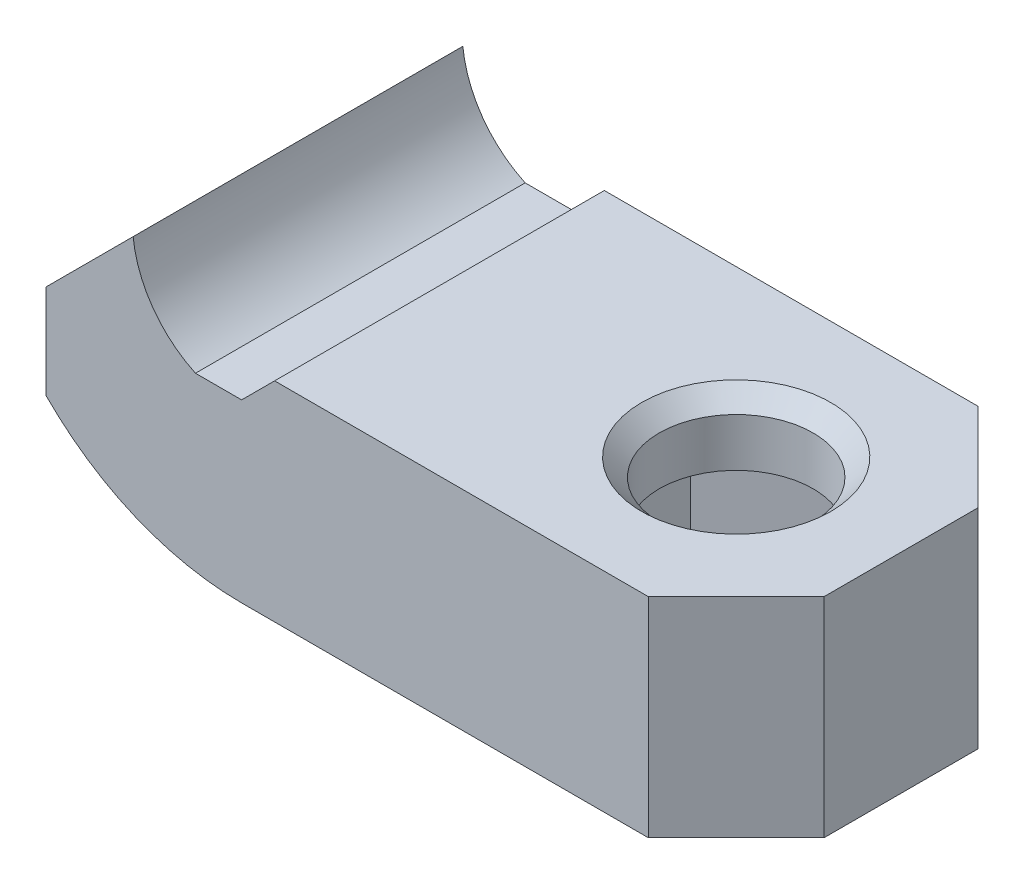
ISO-10303-21;
HEADER;
FILE_DESCRIPTION(('STEP AP214'),'2;1');
FILE_NAME('part.step','',(''),(''),'','','');
FILE_SCHEMA(('AUTOMOTIVE_DESIGN { 1 0 10303 214 1 1 1 1 }'));
ENDSEC;
DATA;
#1=APPLICATION_CONTEXT('core data for automotive mechanical design processes');
#2=APPLICATION_PROTOCOL_DEFINITION('international standard','automotive_design',2000,#1);
#3=PRODUCT_CONTEXT('',#1,'mechanical');
#4=PRODUCT('Part','Part','',(#3));
#5=PRODUCT_RELATED_PRODUCT_CATEGORY('part','',(#4));
#6=PRODUCT_DEFINITION_FORMATION('','',#4);
#7=PRODUCT_DEFINITION_CONTEXT('part definition',#1,'design');
#8=PRODUCT_DEFINITION('design','',#6,#7);
#9=PRODUCT_DEFINITION_SHAPE('','',#8);
#10=(LENGTH_UNIT() NAMED_UNIT(*) SI_UNIT(.MILLI.,.METRE.));
#11=(NAMED_UNIT(*) PLANE_ANGLE_UNIT() SI_UNIT($,.RADIAN.));
#12=(NAMED_UNIT(*) SI_UNIT($,.STERADIAN.) SOLID_ANGLE_UNIT());
#13=UNCERTAINTY_MEASURE_WITH_UNIT(LENGTH_MEASURE(1.E-05),#10,'distance_accuracy_value','');
#14=(GEOMETRIC_REPRESENTATION_CONTEXT(3) GLOBAL_UNCERTAINTY_ASSIGNED_CONTEXT((#13)) GLOBAL_UNIT_ASSIGNED_CONTEXT((#10,
#11,#12)) REPRESENTATION_CONTEXT('',''));
#15=CARTESIAN_POINT('',(0.,0.,0.));
#16=DIRECTION('',(0.,0.,1.));
#17=DIRECTION('',(1.,0.,0.));
#18=AXIS2_PLACEMENT_3D('',#15,#16,#17);
#19=CARTESIAN_POINT('',(-2.1,4.,7.5));
#20=DIRECTION('',(0.,-1.,0.));
#21=DIRECTION('',(1.,0.,0.));
#22=AXIS2_PLACEMENT_3D('',#19,#20,#21);
#23=PLANE('',#22);
#24=DIRECTION('',(-1.,0.,0.));
#25=VECTOR('',#24,1.);
#26=CARTESIAN_POINT('',(-2.1,4.,-7.5));
#27=LINE('',#26,#25);
#28=CARTESIAN_POINT('',(0.,4.,-7.5));
#29=VERTEX_POINT('',#28);
#30=CARTESIAN_POINT('',(-2.1,4.,-7.5));
#31=VERTEX_POINT('',#30);
#32=EDGE_CURVE('E234',#29,#31,#27,.T.);
#33=ORIENTED_EDGE('',*,*,#32,.T.);
#34=DIRECTION('',(0.,0.,-1.));
#35=VECTOR('',#34,1.);
#36=CARTESIAN_POINT('',(-2.1,4.,7.5));
#37=LINE('',#36,#35);
#38=CARTESIAN_POINT('',(-2.1,4.,7.5));
#39=VERTEX_POINT('',#38);
#40=EDGE_CURVE('E272',#39,#31,#37,.T.);
#41=ORIENTED_EDGE('',*,*,#40,.F.);
#42=DIRECTION('',(-1.,0.,0.));
#43=VECTOR('',#42,1.);
#44=CARTESIAN_POINT('',(-2.1,4.,7.5));
#45=LINE('',#44,#43);
#46=CARTESIAN_POINT('',(0.,4.,7.5));
#47=VERTEX_POINT('',#46);
#48=EDGE_CURVE('E239',#47,#39,#45,.T.);
#49=ORIENTED_EDGE('',*,*,#48,.F.);
#50=DIRECTION('',(0.,0.,-1.));
#51=VECTOR('',#50,1.);
#52=CARTESIAN_POINT('',(0.,4.,7.5));
#53=LINE('',#52,#51);
#54=EDGE_CURVE('E275',#47,#29,#53,.T.);
#55=ORIENTED_EDGE('',*,*,#54,.T.);
#56=EDGE_LOOP('',(#33,#41,#49,#55));
#57=FACE_BOUND('',#56,.T.);
#58=ADVANCED_FACE('F35',(#57),#23,.F.);
#59=CARTESIAN_POINT('',(0.,8.5,7.5));
#60=DIRECTION('',(0.,0.,-1.));
#61=DIRECTION('',(-1.,0.,0.));
#62=AXIS2_PLACEMENT_3D('',#59,#60,#61);
#63=CYLINDRICAL_SURFACE('',#62,4.96588360717405);
#64=CARTESIAN_POINT('',(0.,8.5,-7.5));
#65=DIRECTION('',(0.,0.,-1.));
#66=DIRECTION('',(-1.,0.,0.));
#67=AXIS2_PLACEMENT_3D('',#64,#65,#66);
#68=CIRCLE('',#67,4.96588360717405);
#69=CARTESIAN_POINT('',(-4.9367864366808,7.9632135633192,-7.5));
#70=VERTEX_POINT('',#69);
#71=EDGE_CURVE('E253',#31,#70,#68,.T.);
#72=ORIENTED_EDGE('',*,*,#71,.T.);
#73=DIRECTION('',(0.,0.,-1.));
#74=VECTOR('',#73,1.);
#75=CARTESIAN_POINT('',(-4.9367864366808,7.9632135633192,7.5));
#76=LINE('',#75,#74);
#77=CARTESIAN_POINT('',(-4.9367864366808,7.9632135633192,7.5));
#78=VERTEX_POINT('',#77);
#79=EDGE_CURVE('E269',#78,#70,#76,.T.);
#80=ORIENTED_EDGE('',*,*,#79,.F.);
#81=CARTESIAN_POINT('',(0.,8.5,7.5));
#82=DIRECTION('',(0.,0.,-1.));
#83=DIRECTION('',(-1.,0.,0.));
#84=AXIS2_PLACEMENT_3D('',#81,#82,#83);
#85=CIRCLE('',#84,4.96588360717405);
#86=EDGE_CURVE('E241',#39,#78,#85,.T.);
#87=ORIENTED_EDGE('',*,*,#86,.F.);
#88=ORIENTED_EDGE('',*,*,#40,.T.);
#89=EDGE_LOOP('',(#72,#80,#87,#88));
#90=FACE_BOUND('',#89,.T.);
#91=ADVANCED_FACE('F388',(#90),#63,.F.);
#92=CARTESIAN_POINT('',(-8.9,4.,7.5));
#93=DIRECTION('',(0.707106781186547,-0.707106781186548,0.));
#94=DIRECTION('',(0.707106781186548,0.707106781186547,0.));
#95=AXIS2_PLACEMENT_3D('',#92,#93,#94);
#96=PLANE('',#95);
#97=DIRECTION('',(-0.707106781186548,-0.707106781186547,0.));
#98=VECTOR('',#97,1.);
#99=CARTESIAN_POINT('',(-8.9,4.,-7.5));
#100=LINE('',#99,#98);
#101=CARTESIAN_POINT('',(-8.9,4.,-7.5));
#102=VERTEX_POINT('',#101);
#103=EDGE_CURVE('E255',#70,#102,#100,.T.);
#104=ORIENTED_EDGE('',*,*,#103,.T.);
#105=DIRECTION('',(0.,0.,-1.));
#106=VECTOR('',#105,1.);
#107=CARTESIAN_POINT('',(-8.9,4.,7.5));
#108=LINE('',#107,#106);
#109=CARTESIAN_POINT('',(-8.9,4.,7.5));
#110=VERTEX_POINT('',#109);
#111=EDGE_CURVE('E266',#110,#102,#108,.T.);
#112=ORIENTED_EDGE('',*,*,#111,.F.);
#113=DIRECTION('',(-0.707106781186548,-0.707106781186547,0.));
#114=VECTOR('',#113,1.);
#115=CARTESIAN_POINT('',(-8.9,4.,7.5));
#116=LINE('',#115,#114);
#117=EDGE_CURVE('E244',#78,#110,#116,.T.);
#118=ORIENTED_EDGE('',*,*,#117,.F.);
#119=ORIENTED_EDGE('',*,*,#79,.T.);
#120=EDGE_LOOP('',(#104,#112,#118,#119));
#121=FACE_BOUND('',#120,.T.);
#122=ADVANCED_FACE('F394',(#121),#96,.F.);
#123=CARTESIAN_POINT('',(-8.9,4.,7.5));
#124=DIRECTION('',(1.,0.,0.));
#125=DIRECTION('',(0.,1.,0.));
#126=AXIS2_PLACEMENT_3D('',#123,#124,#125);
#127=PLANE('',#126);
#128=DIRECTION('',(0.,-1.,0.));
#129=VECTOR('',#128,1.);
#130=CARTESIAN_POINT('',(-8.9,4.,-7.5));
#131=LINE('',#130,#129);
#132=CARTESIAN_POINT('',(-8.9,-0.277243302996677,-7.5));
#133=VERTEX_POINT('',#132);
#134=EDGE_CURVE('E257',#102,#133,#131,.T.);
#135=ORIENTED_EDGE('',*,*,#134,.T.);
#136=DIRECTION('',(0.,0.,-1.));
#137=VECTOR('',#136,1.);
#138=CARTESIAN_POINT('',(-8.9,-0.277243302996677,7.5));
#139=LINE('',#138,#137);
#140=CARTESIAN_POINT('',(-8.9,-0.277243302996677,7.5));
#141=VERTEX_POINT('',#140);
#142=EDGE_CURVE('E263',#141,#133,#139,.T.);
#143=ORIENTED_EDGE('',*,*,#142,.F.);
#144=DIRECTION('',(0.,-1.,0.));
#145=VECTOR('',#144,1.);
#146=CARTESIAN_POINT('',(-8.9,4.,7.5));
#147=LINE('',#146,#145);
#148=EDGE_CURVE('E246',#110,#141,#147,.T.);
#149=ORIENTED_EDGE('',*,*,#148,.F.);
#150=ORIENTED_EDGE('',*,*,#111,.T.);
#151=EDGE_LOOP('',(#135,#143,#149,#150));
#152=FACE_BOUND('',#151,.T.);
#153=ADVANCED_FACE('F628',(#152),#127,.F.);
#154=CARTESIAN_POINT('',(0.,8.5,7.5));
#155=DIRECTION('',(0.,0.,-1.));
#156=DIRECTION('',(-1.,0.,0.));
#157=AXIS2_PLACEMENT_3D('',#154,#155,#156);
#158=CYLINDRICAL_SURFACE('',#157,12.5);
#159=CARTESIAN_POINT('',(0.,8.5,-7.5));
#160=DIRECTION('',(0.,0.,1.));
#161=DIRECTION('',(-1.,0.,0.));
#162=AXIS2_PLACEMENT_3D('',#159,#160,#161);
#163=CIRCLE('',#162,12.5);
#164=CARTESIAN_POINT('',(0.,-4.,-7.5));
#165=VERTEX_POINT('',#164);
#166=EDGE_CURVE('E242',#133,#165,#163,.T.);
#167=ORIENTED_EDGE('',*,*,#166,.T.);
#168=DIRECTION('',(0.,0.,-1.));
#169=VECTOR('',#168,1.);
#170=CARTESIAN_POINT('',(0.,-4.,7.5));
#171=LINE('',#170,#169);
#172=CARTESIAN_POINT('',(0.,-4.,7.5));
#173=VERTEX_POINT('',#172);
#174=EDGE_CURVE('E251',#173,#165,#171,.T.);
#175=ORIENTED_EDGE('',*,*,#174,.F.);
#176=CARTESIAN_POINT('',(0.,8.5,7.5));
#177=DIRECTION('',(0.,0.,1.));
#178=DIRECTION('',(-1.,0.,0.));
#179=AXIS2_PLACEMENT_3D('',#176,#177,#178);
#180=CIRCLE('',#179,12.5);
#181=EDGE_CURVE('E248',#141,#173,#180,.T.);
#182=ORIENTED_EDGE('',*,*,#181,.F.);
#183=ORIENTED_EDGE('',*,*,#142,.T.);
#184=EDGE_LOOP('',(#167,#175,#182,#183));
#185=FACE_BOUND('',#184,.T.);
#186=ADVANCED_FACE('F600',(#185),#158,.T.);
#187=CARTESIAN_POINT('',(0.,8.5,7.5));
#188=DIRECTION('',(0.,0.,-1.));
#189=DIRECTION('',(-1.,0.,0.));
#190=AXIS2_PLACEMENT_3D('',#187,#188,#189);
#191=PLANE('',#190);
#192=DIRECTION('',(-1.,0.,0.));
#193=VECTOR('',#192,1.);
#194=CARTESIAN_POINT('',(22.5,-4.,7.5));
#195=LINE('',#194,#193);
#196=CARTESIAN_POINT('',(18.5,-4.,7.5));
#197=VERTEX_POINT('',#196);
#198=EDGE_CURVE('E221',#197,#173,#195,.T.);
#199=ORIENTED_EDGE('',*,*,#198,.F.);
#200=DIRECTION('',(0.,1.,0.));
#201=VECTOR('',#200,1.);
#202=CARTESIAN_POINT('',(18.5,5.5,7.5));
#203=LINE('',#202,#201);
#204=CARTESIAN_POINT('',(18.5,5.49999999999707,7.5));
#205=VERTEX_POINT('',#204);
#206=EDGE_CURVE('E296',#197,#205,#203,.T.);
#207=ORIENTED_EDGE('',*,*,#206,.T.);
#208=DIRECTION('',(1.,7.32466336260718E-13,0.));
#209=VECTOR('',#208,1.);
#210=CARTESIAN_POINT('',(1.49999999998461,5.49999999998461,7.5));
#211=LINE('',#210,#209);
#212=CARTESIAN_POINT('',(1.49999999998461,5.49999999998461,7.5));
#213=VERTEX_POINT('',#212);
#214=EDGE_CURVE('E217',#213,#205,#211,.T.);
#215=ORIENTED_EDGE('',*,*,#214,.F.);
#216=DIRECTION('',(0.707106781186547,0.707106781186549,0.));
#217=VECTOR('',#216,1.);
#218=CARTESIAN_POINT('',(0.,4.,7.5));
#219=LINE('',#218,#217);
#220=EDGE_CURVE('E214',#47,#213,#219,.T.);
#221=ORIENTED_EDGE('',*,*,#220,.F.);
#222=ORIENTED_EDGE('',*,*,#48,.T.);
#223=ORIENTED_EDGE('',*,*,#86,.T.);
#224=ORIENTED_EDGE('',*,*,#117,.T.);
#225=ORIENTED_EDGE('',*,*,#148,.T.);
#226=ORIENTED_EDGE('',*,*,#181,.T.);
#227=EDGE_LOOP('',(#199,#207,#215,#221,#222,#223,#224,#225,#226));
#228=FACE_BOUND('',#227,.T.);
#229=ADVANCED_FACE('F590',(#228),#191,.F.);
#230=CARTESIAN_POINT('',(0.,8.5,-7.5));
#231=DIRECTION('',(0.,0.,-1.));
#232=DIRECTION('',(-1.,0.,0.));
#233=AXIS2_PLACEMENT_3D('',#230,#231,#232);
#234=PLANE('',#233);
#235=DIRECTION('',(1.,7.32466336260718E-13,0.));
#236=VECTOR('',#235,1.);
#237=CARTESIAN_POINT('',(1.49999999998461,5.49999999998461,-7.5));
#238=LINE('',#237,#236);
#239=CARTESIAN_POINT('',(1.49999999998461,5.49999999998461,-7.5));
#240=VERTEX_POINT('',#239);
#241=CARTESIAN_POINT('',(18.5,5.49999999999707,-7.5));
#242=VERTEX_POINT('',#241);
#243=EDGE_CURVE('E227',#240,#242,#238,.T.);
#244=ORIENTED_EDGE('',*,*,#243,.T.);
#245=DIRECTION('',(0.,-1.,0.));
#246=VECTOR('',#245,1.);
#247=CARTESIAN_POINT('',(18.5,8.5,-7.5));
#248=LINE('',#247,#246);
#249=CARTESIAN_POINT('',(18.5,-4.,-7.5));
#250=VERTEX_POINT('',#249);
#251=EDGE_CURVE('E278',#242,#250,#248,.T.);
#252=ORIENTED_EDGE('',*,*,#251,.T.);
#253=DIRECTION('',(-1.,0.,0.));
#254=VECTOR('',#253,1.);
#255=CARTESIAN_POINT('',(22.5,-4.,-7.5));
#256=LINE('',#255,#254);
#257=EDGE_CURVE('E218',#250,#165,#256,.T.);
#258=ORIENTED_EDGE('',*,*,#257,.T.);
#259=ORIENTED_EDGE('',*,*,#166,.F.);
#260=ORIENTED_EDGE('',*,*,#134,.F.);
#261=ORIENTED_EDGE('',*,*,#103,.F.);
#262=ORIENTED_EDGE('',*,*,#71,.F.);
#263=ORIENTED_EDGE('',*,*,#32,.F.);
#264=DIRECTION('',(0.707106781186547,0.707106781186549,0.));
#265=VECTOR('',#264,1.);
#266=CARTESIAN_POINT('',(0.,4.,-7.5));
#267=LINE('',#266,#265);
#268=EDGE_CURVE('E224',#29,#240,#267,.T.);
#269=ORIENTED_EDGE('',*,*,#268,.T.);
#270=EDGE_LOOP('',(#244,#252,#258,#259,#260,#261,#262,#263,#269));
#271=FACE_BOUND('',#270,.T.);
#272=ADVANCED_FACE('F582',(#271),#234,.T.);
#273=CARTESIAN_POINT('',(22.5,-4.,7.5));
#274=DIRECTION('',(0.,-1.,0.));
#275=DIRECTION('',(1.,0.,0.));
#276=AXIS2_PLACEMENT_3D('',#273,#274,#275);
#277=PLANE('',#276);
#278=DIRECTION('',(-0.866025403784439,0.,0.5));
#279=VECTOR('',#278,1.);
#280=CARTESIAN_POINT('',(9.69999999999597,-4.,-3.52183664205672));
#281=LINE('',#280,#279);
#282=CARTESIAN_POINT('',(14.999999999996,-4.,-6.58179306876174));
#283=VERTEX_POINT('',#282);
#284=CARTESIAN_POINT('',(9.29999999999597,-4.,-3.29089653438087));
#285=VERTEX_POINT('',#284);
#286=EDGE_CURVE('E307',#283,#285,#281,.T.);
#287=ORIENTED_EDGE('',*,*,#286,.T.);
#288=DIRECTION('',(0.,0.,1.));
#289=VECTOR('',#288,1.);
#290=CARTESIAN_POINT('',(9.29999999999597,-4.,2.82901631902917));
#291=LINE('',#290,#289);
#292=CARTESIAN_POINT('',(9.29999999999597,-4.,3.29089653438087));
#293=VERTEX_POINT('',#292);
#294=EDGE_CURVE('E317',#285,#293,#291,.T.);
#295=ORIENTED_EDGE('',*,*,#294,.T.);
#296=DIRECTION('',(0.866025403784439,0.,0.5));
#297=VECTOR('',#296,1.);
#298=CARTESIAN_POINT('',(14.599999999996,-4.,6.35085296108588));
#299=LINE('',#298,#297);
#300=CARTESIAN_POINT('',(14.999999999996,-4.,6.58179306876173));
#301=VERTEX_POINT('',#300);
#302=EDGE_CURVE('E315',#293,#301,#299,.T.);
#303=ORIENTED_EDGE('',*,*,#302,.T.);
#304=DIRECTION('',(0.866025403784439,0.,-0.5));
#305=VECTOR('',#304,1.);
#306=CARTESIAN_POINT('',(20.299999999996,-4.,3.52183664205672));
#307=LINE('',#306,#305);
#308=CARTESIAN_POINT('',(20.699999999996,-4.,3.29089653438087));
#309=VERTEX_POINT('',#308);
#310=EDGE_CURVE('E313',#301,#309,#307,.T.);
#311=ORIENTED_EDGE('',*,*,#310,.T.);
#312=DIRECTION('',(0.,0.,-1.));
#313=VECTOR('',#312,1.);
#314=CARTESIAN_POINT('',(20.699999999996,-4.,-2.82901631902917));
#315=LINE('',#314,#313);
#316=CARTESIAN_POINT('',(20.699999999996,-4.,-3.29089653438087));
#317=VERTEX_POINT('',#316);
#318=EDGE_CURVE('E311',#309,#317,#315,.T.);
#319=ORIENTED_EDGE('',*,*,#318,.T.);
#320=DIRECTION('',(-0.866025403784439,0.,-0.5));
#321=VECTOR('',#320,1.);
#322=CARTESIAN_POINT('',(15.399999999996,-4.,-6.35085296108589));
#323=LINE('',#322,#321);
#324=EDGE_CURVE('E309',#317,#283,#323,.T.);
#325=ORIENTED_EDGE('',*,*,#324,.T.);
#326=EDGE_LOOP('',(#287,#295,#303,#311,#319,#325));
#327=FACE_BOUND('',#326,.T.);
#328=ORIENTED_EDGE('',*,*,#257,.F.);
#329=DIRECTION('',(-0.707106781186546,0.,-0.707106781186549));
#330=VECTOR('',#329,1.);
#331=CARTESIAN_POINT('',(28.,-4.,2.00000000000002));
#332=LINE('',#331,#330);
#333=CARTESIAN_POINT('',(22.5,-4.,-3.49999999999999));
#334=VERTEX_POINT('',#333);
#335=EDGE_CURVE('E285',#250,#334,#332,.F.);
#336=ORIENTED_EDGE('',*,*,#335,.T.);
#337=DIRECTION('',(0.,0.,-1.));
#338=VECTOR('',#337,1.);
#339=CARTESIAN_POINT('',(22.5,-4.,7.5));
#340=LINE('',#339,#338);
#341=CARTESIAN_POINT('',(22.5,-4.,3.5));
#342=VERTEX_POINT('',#341);
#343=EDGE_CURVE('E231',#342,#334,#340,.T.);
#344=ORIENTED_EDGE('',*,*,#343,.F.);
#345=DIRECTION('',(-0.707106781186549,0.,0.707106781186546));
#346=VECTOR('',#345,1.);
#347=CARTESIAN_POINT('',(20.5,-4.,5.49999999999999));
#348=LINE('',#347,#346);
#349=EDGE_CURVE('E283',#342,#197,#348,.T.);
#350=ORIENTED_EDGE('',*,*,#349,.T.);
#351=ORIENTED_EDGE('',*,*,#198,.T.);
#352=ORIENTED_EDGE('',*,*,#174,.T.);
#353=EDGE_LOOP('',(#328,#336,#344,#350,#351,#352));
#354=FACE_BOUND('',#353,.T.);
#355=ADVANCED_FACE('F374',(#327,#354),#277,.T.);
#356=CARTESIAN_POINT('',(22.5,5.5,7.5));
#357=DIRECTION('',(1.,0.,0.));
#358=DIRECTION('',(0.,0.,-1.));
#359=AXIS2_PLACEMENT_3D('',#356,#357,#358);
#360=PLANE('',#359);
#361=ORIENTED_EDGE('',*,*,#343,.T.);
#362=DIRECTION('',(0.,1.,0.));
#363=VECTOR('',#362,1.);
#364=CARTESIAN_POINT('',(22.5,5.5,-3.49999999999999));
#365=LINE('',#364,#363);
#366=CARTESIAN_POINT('',(22.5,5.5,-3.49999999999999));
#367=VERTEX_POINT('',#366);
#368=EDGE_CURVE('E290',#334,#367,#365,.T.);
#369=ORIENTED_EDGE('',*,*,#368,.T.);
#370=DIRECTION('',(0.,0.,-1.));
#371=VECTOR('',#370,1.);
#372=CARTESIAN_POINT('',(22.5,5.5,7.5));
#373=LINE('',#372,#371);
#374=CARTESIAN_POINT('',(22.5,5.5,3.5));
#375=VERTEX_POINT('',#374);
#376=EDGE_CURVE('E235',#375,#367,#373,.T.);
#377=ORIENTED_EDGE('',*,*,#376,.F.);
#378=DIRECTION('',(0.,-1.,0.));
#379=VECTOR('',#378,1.);
#380=CARTESIAN_POINT('',(22.5,-4.,3.5));
#381=LINE('',#380,#379);
#382=EDGE_CURVE('E287',#375,#342,#381,.T.);
#383=ORIENTED_EDGE('',*,*,#382,.T.);
#384=EDGE_LOOP('',(#361,#369,#377,#383));
#385=FACE_BOUND('',#384,.T.);
#386=ADVANCED_FACE('F566',(#385),#360,.T.);
#387=CARTESIAN_POINT('',(1.49999999998461,5.49999999998461,7.5));
#388=DIRECTION('',(-7.32466336260718E-13,1.,0.));
#389=DIRECTION('',(-1.,-7.32466336260718E-13,0.));
#390=AXIS2_PLACEMENT_3D('',#387,#388,#389);
#391=PLANE('',#390);
#392=CARTESIAN_POINT('',(14.999999999996,5.4999999999945,0.));
#393=DIRECTION('',(-7.32466336260718E-13,1.,0.));
#394=DIRECTION('',(-1.,-7.32466336260718E-13,0.));
#395=AXIS2_PLACEMENT_3D('',#392,#393,#394);
#396=CIRCLE('',#395,4.3000000000041);
#397=CARTESIAN_POINT('',(10.6999999999919,5.49999999999135,0.));
#398=VERTEX_POINT('',#397);
#399=EDGE_CURVE('E301',#398,#398,#396,.F.);
#400=ORIENTED_EDGE('',*,*,#399,.T.);
#401=EDGE_LOOP('',(#400));
#402=FACE_BOUND('',#401,.T.);
#403=ORIENTED_EDGE('',*,*,#376,.T.);
#404=DIRECTION('',(0.707106781186546,5.17931913360819E-13,0.707106781186549));
#405=VECTOR('',#404,1.);
#406=CARTESIAN_POINT('',(17.4999999999923,5.49999999999634,-8.50000000000767));
#407=LINE('',#406,#405);
#408=EDGE_CURVE('E294',#367,#242,#407,.F.);
#409=ORIENTED_EDGE('',*,*,#408,.T.);
#410=ORIENTED_EDGE('',*,*,#243,.F.);
#411=DIRECTION('',(0.,0.,-1.));
#412=VECTOR('',#411,1.);
#413=CARTESIAN_POINT('',(1.49999999998461,5.49999999998461,7.5));
#414=LINE('',#413,#412);
#415=EDGE_CURVE('E223',#213,#240,#414,.T.);
#416=ORIENTED_EDGE('',*,*,#415,.F.);
#417=ORIENTED_EDGE('',*,*,#214,.T.);
#418=DIRECTION('',(0.707106781186549,5.17931913360821E-13,-0.707106781186546));
#419=VECTOR('',#418,1.);
#420=CARTESIAN_POINT('',(9.99999999999227,5.49999999999084,16.0000000000077));
#421=LINE('',#420,#419);
#422=EDGE_CURVE('E292',#205,#375,#421,.T.);
#423=ORIENTED_EDGE('',*,*,#422,.T.);
#424=EDGE_LOOP('',(#403,#409,#410,#416,#417,#423));
#425=FACE_BOUND('',#424,.T.);
#426=ADVANCED_FACE('F557',(#402,#425),#391,.T.);
#427=CARTESIAN_POINT('',(0.,4.,7.5));
#428=DIRECTION('',(-0.707106781186549,0.707106781186547,0.));
#429=DIRECTION('',(-0.707106781186547,-0.707106781186549,0.));
#430=AXIS2_PLACEMENT_3D('',#427,#428,#429);
#431=PLANE('',#430);
#432=ORIENTED_EDGE('',*,*,#268,.F.);
#433=ORIENTED_EDGE('',*,*,#54,.F.);
#434=ORIENTED_EDGE('',*,*,#220,.T.);
#435=ORIENTED_EDGE('',*,*,#415,.T.);
#436=EDGE_LOOP('',(#432,#433,#434,#435));
#437=FACE_BOUND('',#436,.T.);
#438=ADVANCED_FACE('F548',(#437),#431,.T.);
#439=CARTESIAN_POINT('',(14.999999999996,-4.,0.));
#440=DIRECTION('',(0.,1.,0.));
#441=DIRECTION('',(-1.,0.,0.));
#442=AXIS2_PLACEMENT_3D('',#439,#440,#441);
#443=CYLINDRICAL_SURFACE('',#442,3.5);
#444=CARTESIAN_POINT('',(14.999999999996,4.69999999998785,0.));
#445=DIRECTION('',(0.,1.,0.));
#446=DIRECTION('',(0.,0.,1.));
#447=AXIS2_PLACEMENT_3D('',#444,#445,#446);
#448=CIRCLE('',#447,3.5);
#449=CARTESIAN_POINT('',(14.999999999996,4.69999999998785,3.5));
#450=VERTEX_POINT('',#449);
#451=EDGE_CURVE('E298',#450,#450,#448,.T.);
#452=ORIENTED_EDGE('',*,*,#451,.T.);
#453=EDGE_LOOP('',(#452));
#454=FACE_BOUND('',#453,.T.);
#455=CARTESIAN_POINT('',(14.999999999996,2.49999999998351,0.));
#456=DIRECTION('',(0.,1.,0.));
#457=DIRECTION('',(-1.,0.,0.));
#458=AXIS2_PLACEMENT_3D('',#455,#456,#457);
#459=CIRCLE('',#458,3.5);
#460=CARTESIAN_POINT('',(11.499999999996,2.49999999998351,0.));
#461=VERTEX_POINT('',#460);
#462=EDGE_CURVE('E206',#461,#461,#459,.F.);
#463=ORIENTED_EDGE('',*,*,#462,.T.);
#464=EDGE_LOOP('',(#463));
#465=FACE_BOUND('',#464,.T.);
#466=ADVANCED_FACE('F539',(#454,#465),#443,.F.);
#467=CARTESIAN_POINT('',(0.,2.49999999998352,0.));
#468=DIRECTION('',(0.,1.,0.));
#469=DIRECTION('',(-1.,0.,0.));
#470=AXIS2_PLACEMENT_3D('',#467,#468,#469);
#471=PLANE('',#470);
#472=DIRECTION('',(-0.866025403784439,0.,-0.5));
#473=VECTOR('',#472,1.);
#474=CARTESIAN_POINT('',(19.899999999996,2.49999999998351,-2.82901631902917));
#475=LINE('',#474,#473);
#476=CARTESIAN_POINT('',(19.899999999996,2.49999999998351,-2.82901631902917));
#477=VERTEX_POINT('',#476);
#478=CARTESIAN_POINT('',(14.999999999996,2.49999999998351,-5.65803263805833));
#479=VERTEX_POINT('',#478);
#480=EDGE_CURVE('E185',#477,#479,#475,.T.);
#481=ORIENTED_EDGE('',*,*,#480,.F.);
#482=DIRECTION('',(0.,0.,-1.));
#483=VECTOR('',#482,1.);
#484=CARTESIAN_POINT('',(19.899999999996,2.49999999998351,2.82901631902916));
#485=LINE('',#484,#483);
#486=CARTESIAN_POINT('',(19.899999999996,2.49999999998351,2.82901631902916));
#487=VERTEX_POINT('',#486);
#488=EDGE_CURVE('E177',#487,#477,#485,.T.);
#489=ORIENTED_EDGE('',*,*,#488,.F.);
#490=DIRECTION('',(0.866025403784439,0.,-0.5));
#491=VECTOR('',#490,1.);
#492=CARTESIAN_POINT('',(14.999999999996,2.49999999998351,5.65803263805833));
#493=LINE('',#492,#491);
#494=CARTESIAN_POINT('',(14.999999999996,2.49999999998351,5.65803263805833));
#495=VERTEX_POINT('',#494);
#496=EDGE_CURVE('E201',#495,#487,#493,.T.);
#497=ORIENTED_EDGE('',*,*,#496,.F.);
#498=DIRECTION('',(0.866025403784439,0.,0.5));
#499=VECTOR('',#498,1.);
#500=CARTESIAN_POINT('',(10.099999999996,2.49999999998352,2.82901631902917));
#501=LINE('',#500,#499);
#502=CARTESIAN_POINT('',(10.099999999996,2.49999999998352,2.82901631902917));
#503=VERTEX_POINT('',#502);
#504=EDGE_CURVE('E198',#503,#495,#501,.T.);
#505=ORIENTED_EDGE('',*,*,#504,.F.);
#506=DIRECTION('',(0.,0.,1.));
#507=VECTOR('',#506,1.);
#508=CARTESIAN_POINT('',(10.099999999996,2.49999999998352,-2.82901631902917));
#509=LINE('',#508,#507);
#510=CARTESIAN_POINT('',(10.099999999996,2.49999999998352,-2.82901631902917));
#511=VERTEX_POINT('',#510);
#512=EDGE_CURVE('E189',#511,#503,#509,.T.);
#513=ORIENTED_EDGE('',*,*,#512,.F.);
#514=DIRECTION('',(-0.866025403784439,0.,0.5));
#515=VECTOR('',#514,1.);
#516=CARTESIAN_POINT('',(14.999999999996,2.49999999998351,-5.65803263805833));
#517=LINE('',#516,#515);
#518=EDGE_CURVE('E174',#479,#511,#517,.T.);
#519=ORIENTED_EDGE('',*,*,#518,.F.);
#520=EDGE_LOOP('',(#481,#489,#497,#505,#513,#519));
#521=FACE_BOUND('',#520,.T.);
#522=ORIENTED_EDGE('',*,*,#462,.F.);
#523=EDGE_LOOP('',(#522));
#524=FACE_BOUND('',#523,.T.);
#525=ADVANCED_FACE('F182',(#521,#524),#471,.F.);
#526=CARTESIAN_POINT('',(19.899999999996,-7.50000000001649,-2.82901631902917));
#527=DIRECTION('',(0.5,0.,-0.866025403784439));
#528=DIRECTION('',(-0.866025403784439,0.,-0.5));
#529=AXIS2_PLACEMENT_3D('',#526,#527,#528);
#530=PLANE('',#529);
#531=DIRECTION('',(0.,1.,0.));
#532=VECTOR('',#531,1.);
#533=CARTESIAN_POINT('',(14.999999999996,-7.50000000001649,-5.65803263805833));
#534=LINE('',#533,#532);
#535=CARTESIAN_POINT('',(14.999999999996,-3.2,-5.65803263805833));
#536=VERTEX_POINT('',#535);
#537=EDGE_CURVE('E171',#536,#479,#534,.T.);
#538=ORIENTED_EDGE('',*,*,#537,.F.);
#539=DIRECTION('',(0.866025403784439,0.,0.5));
#540=VECTOR('',#539,1.);
#541=CARTESIAN_POINT('',(19.899999999996,-3.2,-2.82901631902917));
#542=LINE('',#541,#540);
#543=CARTESIAN_POINT('',(19.899999999996,-3.2,-2.82901631902917));
#544=VERTEX_POINT('',#543);
#545=EDGE_CURVE('E45',#536,#544,#542,.T.);
#546=ORIENTED_EDGE('',*,*,#545,.T.);
#547=DIRECTION('',(0.,1.,0.));
#548=VECTOR('',#547,1.);
#549=CARTESIAN_POINT('',(19.899999999996,-7.50000000001649,-2.82901631902917));
#550=LINE('',#549,#548);
#551=EDGE_CURVE('E192',#544,#477,#550,.T.);
#552=ORIENTED_EDGE('',*,*,#551,.T.);
#553=ORIENTED_EDGE('',*,*,#480,.T.);
#554=EDGE_LOOP('',(#538,#546,#552,#553));
#555=FACE_BOUND('',#554,.T.);
#556=ADVANCED_FACE('F191',(#555),#530,.F.);
#557=CARTESIAN_POINT('',(19.899999999996,-7.50000000001649,2.82901631902916));
#558=DIRECTION('',(1.,0.,0.));
#559=DIRECTION('',(0.,0.,-1.));
#560=AXIS2_PLACEMENT_3D('',#557,#558,#559);
#561=PLANE('',#560);
#562=ORIENTED_EDGE('',*,*,#551,.F.);
#563=DIRECTION('',(0.,0.,1.));
#564=VECTOR('',#563,1.);
#565=CARTESIAN_POINT('',(19.899999999996,-3.2,2.82901631902916));
#566=LINE('',#565,#564);
#567=CARTESIAN_POINT('',(19.899999999996,-3.2,2.82901631902916));
#568=VERTEX_POINT('',#567);
#569=EDGE_CURVE('E324',#544,#568,#566,.T.);
#570=ORIENTED_EDGE('',*,*,#569,.T.);
#571=DIRECTION('',(0.,1.,0.));
#572=VECTOR('',#571,1.);
#573=CARTESIAN_POINT('',(19.899999999996,-7.50000000001649,2.82901631902916));
#574=LINE('',#573,#572);
#575=EDGE_CURVE('E207',#568,#487,#574,.T.);
#576=ORIENTED_EDGE('',*,*,#575,.T.);
#577=ORIENTED_EDGE('',*,*,#488,.T.);
#578=EDGE_LOOP('',(#562,#570,#576,#577));
#579=FACE_BOUND('',#578,.T.);
#580=ADVANCED_FACE('F349',(#579),#561,.F.);
#581=CARTESIAN_POINT('',(14.999999999996,-7.50000000001649,5.65803263805833));
#582=DIRECTION('',(0.5,0.,0.866025403784439));
#583=DIRECTION('',(0.866025403784439,0.,-0.5));
#584=AXIS2_PLACEMENT_3D('',#581,#582,#583);
#585=PLANE('',#584);
#586=ORIENTED_EDGE('',*,*,#575,.F.);
#587=DIRECTION('',(-0.866025403784439,0.,0.5));
#588=VECTOR('',#587,1.);
#589=CARTESIAN_POINT('',(14.999999999996,-3.2,5.65803263805833));
#590=LINE('',#589,#588);
#591=CARTESIAN_POINT('',(14.999999999996,-3.2,5.65803263805833));
#592=VERTEX_POINT('',#591);
#593=EDGE_CURVE('E322',#568,#592,#590,.T.);
#594=ORIENTED_EDGE('',*,*,#593,.T.);
#595=DIRECTION('',(0.,1.,0.));
#596=VECTOR('',#595,1.);
#597=CARTESIAN_POINT('',(14.999999999996,-7.50000000001649,5.65803263805833));
#598=LINE('',#597,#596);
#599=EDGE_CURVE('E209',#592,#495,#598,.T.);
#600=ORIENTED_EDGE('',*,*,#599,.T.);
#601=ORIENTED_EDGE('',*,*,#496,.T.);
#602=EDGE_LOOP('',(#586,#594,#600,#601));
#603=FACE_BOUND('',#602,.T.);
#604=ADVANCED_FACE('F351',(#603),#585,.F.);
#605=CARTESIAN_POINT('',(10.099999999996,-7.50000000001648,2.82901631902917));
#606=DIRECTION('',(-0.5,0.,0.866025403784439));
#607=DIRECTION('',(0.866025403784439,0.,0.5));
#608=AXIS2_PLACEMENT_3D('',#605,#606,#607);
#609=PLANE('',#608);
#610=ORIENTED_EDGE('',*,*,#599,.F.);
#611=DIRECTION('',(-0.866025403784439,0.,-0.5));
#612=VECTOR('',#611,1.);
#613=CARTESIAN_POINT('',(10.099999999996,-3.2,2.82901631902917));
#614=LINE('',#613,#612);
#615=CARTESIAN_POINT('',(10.099999999996,-3.2,2.82901631902917));
#616=VERTEX_POINT('',#615);
#617=EDGE_CURVE('E320',#592,#616,#614,.T.);
#618=ORIENTED_EDGE('',*,*,#617,.T.);
#619=DIRECTION('',(0.,1.,0.));
#620=VECTOR('',#619,1.);
#621=CARTESIAN_POINT('',(10.099999999996,-7.50000000001648,2.82901631902917));
#622=LINE('',#621,#620);
#623=EDGE_CURVE('E211',#616,#503,#622,.T.);
#624=ORIENTED_EDGE('',*,*,#623,.T.);
#625=ORIENTED_EDGE('',*,*,#504,.T.);
#626=EDGE_LOOP('',(#610,#618,#624,#625));
#627=FACE_BOUND('',#626,.T.);
#628=ADVANCED_FACE('F355',(#627),#609,.F.);
#629=CARTESIAN_POINT('',(10.099999999996,-7.50000000001648,-2.82901631902917));
#630=DIRECTION('',(-1.,0.,0.));
#631=DIRECTION('',(0.,0.,1.));
#632=AXIS2_PLACEMENT_3D('',#629,#630,#631);
#633=PLANE('',#632);
#634=ORIENTED_EDGE('',*,*,#623,.F.);
#635=DIRECTION('',(0.,0.,-1.));
#636=VECTOR('',#635,1.);
#637=CARTESIAN_POINT('',(10.099999999996,-3.2,-2.82901631902917));
#638=LINE('',#637,#636);
#639=CARTESIAN_POINT('',(10.099999999996,-3.2,-2.82901631902917));
#640=VERTEX_POINT('',#639);
#641=EDGE_CURVE('E304',#616,#640,#638,.T.);
#642=ORIENTED_EDGE('',*,*,#641,.T.);
#643=DIRECTION('',(0.,1.,0.));
#644=VECTOR('',#643,1.);
#645=CARTESIAN_POINT('',(10.099999999996,-7.50000000001648,-2.82901631902917));
#646=LINE('',#645,#644);
#647=EDGE_CURVE('E176',#640,#511,#646,.T.);
#648=ORIENTED_EDGE('',*,*,#647,.T.);
#649=ORIENTED_EDGE('',*,*,#512,.T.);
#650=EDGE_LOOP('',(#634,#642,#648,#649));
#651=FACE_BOUND('',#650,.T.);
#652=ADVANCED_FACE('F361',(#651),#633,.F.);
#653=CARTESIAN_POINT('',(14.999999999996,-7.50000000001649,-5.65803263805833));
#654=DIRECTION('',(-0.5,0.,-0.866025403784439));
#655=DIRECTION('',(-0.866025403784439,0.,0.5));
#656=AXIS2_PLACEMENT_3D('',#653,#654,#655);
#657=PLANE('',#656);
#658=ORIENTED_EDGE('',*,*,#647,.F.);
#659=DIRECTION('',(0.866025403784439,0.,-0.5));
#660=VECTOR('',#659,1.);
#661=CARTESIAN_POINT('',(14.999999999996,-3.2,-5.65803263805833));
#662=LINE('',#661,#660);
#663=EDGE_CURVE('E11',#640,#536,#662,.T.);
#664=ORIENTED_EDGE('',*,*,#663,.T.);
#665=ORIENTED_EDGE('',*,*,#537,.T.);
#666=ORIENTED_EDGE('',*,*,#518,.T.);
#667=EDGE_LOOP('',(#658,#664,#665,#666));
#668=FACE_BOUND('',#667,.T.);
#669=ADVANCED_FACE('F173',(#668),#657,.F.);
#670=CARTESIAN_POINT('',(18.5,8.5,-7.5));
#671=DIRECTION('',(-0.707106781186549,0.,0.707106781186546));
#672=DIRECTION('',(0.,-1.,0.));
#673=AXIS2_PLACEMENT_3D('',#670,#671,#672);
#674=PLANE('',#673);
#675=ORIENTED_EDGE('',*,*,#408,.F.);
#676=ORIENTED_EDGE('',*,*,#368,.F.);
#677=ORIENTED_EDGE('',*,*,#335,.F.);
#678=ORIENTED_EDGE('',*,*,#251,.F.);
#679=EDGE_LOOP('',(#675,#676,#677,#678));
#680=FACE_BOUND('',#679,.T.);
#681=ADVANCED_FACE('F400',(#680),#674,.F.);
#682=CARTESIAN_POINT('',(22.5,5.5,3.5));
#683=DIRECTION('',(0.707106781186546,0.,0.707106781186549));
#684=DIRECTION('',(0.,1.,0.));
#685=AXIS2_PLACEMENT_3D('',#682,#683,#684);
#686=PLANE('',#685);
#687=ORIENTED_EDGE('',*,*,#422,.F.);
#688=ORIENTED_EDGE('',*,*,#206,.F.);
#689=ORIENTED_EDGE('',*,*,#349,.F.);
#690=ORIENTED_EDGE('',*,*,#382,.F.);
#691=EDGE_LOOP('',(#687,#688,#689,#690));
#692=FACE_BOUND('',#691,.T.);
#693=ADVANCED_FACE('F406',(#692),#686,.T.);
#694=CARTESIAN_POINT('',(14.999999999996,4.69999999998785,0.));
#695=DIRECTION('',(0.,1.,0.));
#696=DIRECTION('',(0.,0.,1.));
#697=AXIS2_PLACEMENT_3D('',#694,#695,#696);
#698=CONICAL_SURFACE('',#697,3.5,0.785398163397817);
#699=ORIENTED_EDGE('',*,*,#399,.F.);
#700=EDGE_LOOP('',(#699));
#701=FACE_BOUND('',#700,.T.);
#702=ORIENTED_EDGE('',*,*,#451,.F.);
#703=EDGE_LOOP('',(#702));
#704=FACE_BOUND('',#703,.T.);
#705=ADVANCED_FACE('F385',(#701,#704),#698,.F.);
#706=CARTESIAN_POINT('',(19.899999999996,-3.2,2.82901631902916));
#707=DIRECTION('',(-0.707106781186545,-0.70710678118655,0.));
#708=DIRECTION('',(0.,0.,-1.));
#709=AXIS2_PLACEMENT_3D('',#706,#707,#708);
#710=PLANE('',#709);
#711=DIRECTION('',(-0.654653670707979,0.654653670707975,0.377964473009228));
#712=VECTOR('',#711,1.);
#713=CARTESIAN_POINT('',(18.499999999996,-1.8,-2.02072594216369));
#714=LINE('',#713,#712);
#715=EDGE_CURVE('E195',#317,#544,#714,.T.);
#716=ORIENTED_EDGE('',*,*,#715,.F.);
#717=ORIENTED_EDGE('',*,*,#318,.F.);
#718=DIRECTION('',(-0.654653670707979,0.654653670707975,-0.377964473009227));
#719=VECTOR('',#718,1.);
#720=CARTESIAN_POINT('',(18.499999999996,-1.8,2.02072594216368));
#721=LINE('',#720,#719);
#722=EDGE_CURVE('E40',#568,#309,#721,.F.);
#723=ORIENTED_EDGE('',*,*,#722,.F.);
#724=ORIENTED_EDGE('',*,*,#569,.F.);
#725=EDGE_LOOP('',(#716,#717,#723,#724));
#726=FACE_BOUND('',#725,.T.);
#727=ADVANCED_FACE('F38',(#726),#710,.T.);
#728=CARTESIAN_POINT('',(14.999999999996,-3.2,5.65803263805833));
#729=DIRECTION('',(-0.353553390593273,-0.707106781186549,-0.612372435695793));
#730=DIRECTION('',(0.866025403784439,0.,-0.5));
#731=AXIS2_PLACEMENT_3D('',#728,#729,#730);
#732=PLANE('',#731);
#733=ORIENTED_EDGE('',*,*,#722,.T.);
#734=ORIENTED_EDGE('',*,*,#310,.F.);
#735=DIRECTION('',(0.,0.654653670707975,-0.755928946018456));
#736=VECTOR('',#735,1.);
#737=CARTESIAN_POINT('',(14.999999999996,-1.8,4.04145188432737));
#738=LINE('',#737,#736);
#739=EDGE_CURVE('E334',#592,#301,#738,.F.);
#740=ORIENTED_EDGE('',*,*,#739,.F.);
#741=ORIENTED_EDGE('',*,*,#593,.F.);
#742=EDGE_LOOP('',(#733,#734,#740,#741));
#743=FACE_BOUND('',#742,.T.);
#744=ADVANCED_FACE('F378',(#743),#732,.T.);
#745=CARTESIAN_POINT('',(19.899999999996,-3.2,-2.82901631902917));
#746=DIRECTION('',(-0.353553390593273,-0.70710678118655,0.612372435695793));
#747=DIRECTION('',(-0.866025403784439,0.,-0.5));
#748=AXIS2_PLACEMENT_3D('',#745,#746,#747);
#749=PLANE('',#748);
#750=ORIENTED_EDGE('',*,*,#715,.T.);
#751=ORIENTED_EDGE('',*,*,#545,.F.);
#752=DIRECTION('',(0.,0.654653670707975,0.755928946018456));
#753=VECTOR('',#752,1.);
#754=CARTESIAN_POINT('',(14.999999999996,-1.80000000000001,-4.04145188432738));
#755=LINE('',#754,#753);
#756=EDGE_CURVE('E331',#283,#536,#755,.T.);
#757=ORIENTED_EDGE('',*,*,#756,.F.);
#758=ORIENTED_EDGE('',*,*,#324,.F.);
#759=EDGE_LOOP('',(#750,#751,#757,#758));
#760=FACE_BOUND('',#759,.T.);
#761=ADVANCED_FACE('F340',(#760),#749,.T.);
#762=CARTESIAN_POINT('',(10.099999999996,-3.2,2.82901631902917));
#763=DIRECTION('',(0.353553390593273,-0.707106781186549,-0.612372435695793));
#764=DIRECTION('',(0.866025403784439,0.,0.5));
#765=AXIS2_PLACEMENT_3D('',#762,#763,#764);
#766=PLANE('',#765);
#767=ORIENTED_EDGE('',*,*,#739,.T.);
#768=ORIENTED_EDGE('',*,*,#302,.F.);
#769=DIRECTION('',(0.654653670707978,0.654653670707975,-0.377964473009229));
#770=VECTOR('',#769,1.);
#771=CARTESIAN_POINT('',(11.499999999996,-1.8,2.02072594216369));
#772=LINE('',#771,#770);
#773=EDGE_CURVE('E329',#616,#293,#772,.F.);
#774=ORIENTED_EDGE('',*,*,#773,.F.);
#775=ORIENTED_EDGE('',*,*,#617,.F.);
#776=EDGE_LOOP('',(#767,#768,#774,#775));
#777=FACE_BOUND('',#776,.T.);
#778=ADVANCED_FACE('F365',(#777),#766,.T.);
#779=CARTESIAN_POINT('',(14.999999999996,-3.2,-5.65803263805833));
#780=DIRECTION('',(0.353553390593273,-0.707106781186549,0.612372435695793));
#781=DIRECTION('',(-0.866025403784439,0.,0.5));
#782=AXIS2_PLACEMENT_3D('',#779,#780,#781);
#783=PLANE('',#782);
#784=ORIENTED_EDGE('',*,*,#756,.T.);
#785=ORIENTED_EDGE('',*,*,#663,.F.);
#786=DIRECTION('',(-0.654653670707978,-0.654653670707975,-0.377964473009228));
#787=VECTOR('',#786,1.);
#788=CARTESIAN_POINT('',(10.099999999996,-3.2,-2.82901631902917));
#789=LINE('',#788,#787);
#790=EDGE_CURVE('E327',#285,#640,#789,.F.);
#791=ORIENTED_EDGE('',*,*,#790,.F.);
#792=ORIENTED_EDGE('',*,*,#286,.F.);
#793=EDGE_LOOP('',(#784,#785,#791,#792));
#794=FACE_BOUND('',#793,.T.);
#795=ADVANCED_FACE('F372',(#794),#783,.T.);
#796=CARTESIAN_POINT('',(10.099999999996,-3.2,-2.82901631902917));
#797=DIRECTION('',(0.707106781186546,-0.707106781186549,0.));
#798=DIRECTION('',(0.,0.,1.));
#799=AXIS2_PLACEMENT_3D('',#796,#797,#798);
#800=PLANE('',#799);
#801=ORIENTED_EDGE('',*,*,#773,.T.);
#802=ORIENTED_EDGE('',*,*,#294,.F.);
#803=ORIENTED_EDGE('',*,*,#790,.T.);
#804=ORIENTED_EDGE('',*,*,#641,.F.);
#805=EDGE_LOOP('',(#801,#802,#803,#804));
#806=FACE_BOUND('',#805,.T.);
#807=ADVANCED_FACE('F368',(#806),#800,.T.);
#808=CLOSED_SHELL('',(#58,#91,#122,#153,#186,#229,#272,#355,#386,#426,#438,#466,#525,#556,#580,
#604,#628,#652,#669,#681,#693,#705,#727,#744,#761,#778,#795,#807));
#809=MANIFOLD_SOLID_BREP('B2',#808);
#810=ADVANCED_BREP_SHAPE_REPRESENTATION('',(#18,#809),#14);
#811=SHAPE_DEFINITION_REPRESENTATION(#9,#810);
ENDSEC;
END-ISO-10303-21;
